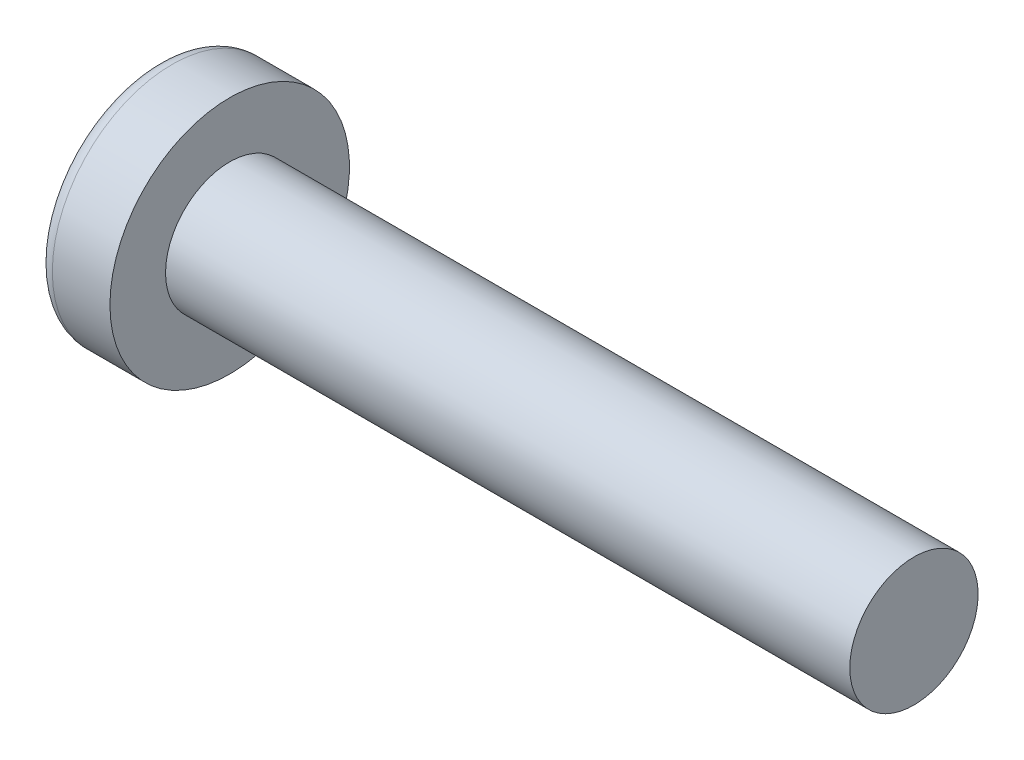
ISO-10303-21;
HEADER;
FILE_DESCRIPTION(('STEP AP214'),'2;1');
FILE_NAME('part.step','',(''),(''),'','','');
FILE_SCHEMA(('AUTOMOTIVE_DESIGN { 1 0 10303 214 1 1 1 1 }'));
ENDSEC;
DATA;
#1=APPLICATION_CONTEXT('core data for automotive mechanical design processes');
#2=APPLICATION_PROTOCOL_DEFINITION('international standard','automotive_design',2000,#1);
#3=PRODUCT_CONTEXT('',#1,'mechanical');
#4=PRODUCT('Part','Part','',(#3));
#5=PRODUCT_RELATED_PRODUCT_CATEGORY('part','',(#4));
#6=PRODUCT_DEFINITION_FORMATION('','',#4);
#7=PRODUCT_DEFINITION_CONTEXT('part definition',#1,'design');
#8=PRODUCT_DEFINITION('design','',#6,#7);
#9=PRODUCT_DEFINITION_SHAPE('','',#8);
#10=(LENGTH_UNIT() NAMED_UNIT(*) SI_UNIT(.MILLI.,.METRE.));
#11=(NAMED_UNIT(*) PLANE_ANGLE_UNIT() SI_UNIT($,.RADIAN.));
#12=(NAMED_UNIT(*) SI_UNIT($,.STERADIAN.) SOLID_ANGLE_UNIT());
#13=UNCERTAINTY_MEASURE_WITH_UNIT(LENGTH_MEASURE(1.E-05),#10,'distance_accuracy_value','');
#14=(GEOMETRIC_REPRESENTATION_CONTEXT(3) GLOBAL_UNCERTAINTY_ASSIGNED_CONTEXT((#13)) GLOBAL_UNIT_ASSIGNED_CONTEXT((#10,
#11,#12)) REPRESENTATION_CONTEXT('',''));
#15=CARTESIAN_POINT('',(0.,0.,0.));
#16=DIRECTION('',(0.,0.,1.));
#17=DIRECTION('',(1.,0.,0.));
#18=AXIS2_PLACEMENT_3D('',#15,#16,#17);
#19=CARTESIAN_POINT('',(5.,0.,0.));
#20=DIRECTION('',(-1.,0.,0.));
#21=DIRECTION('',(0.,1.,0.));
#22=AXIS2_PLACEMENT_3D('',#19,#20,#21);
#23=SPHERICAL_SURFACE('',#22,5.);
#24=CARTESIAN_POINT('',(0.747150706810473,0.,0.));
#25=DIRECTION('',(-1.,0.,0.));
#26=DIRECTION('',(0.,0.,1.));
#27=AXIS2_PLACEMENT_3D('',#24,#25,#26);
#28=CIRCLE('',#27,2.62931034482758);
#29=CARTESIAN_POINT('',(0.747150706810473,0.,2.62931034482758));
#30=VERTEX_POINT('',#29);
#31=EDGE_CURVE('E137',#30,#30,#28,.T.);
#32=ORIENTED_EDGE('',*,*,#31,.T.);
#33=EDGE_LOOP('',(#32));
#34=FACE_BOUND('',#33,.T.);
#35=CARTESIAN_POINT('',(4.98382636322272,-0.153868112043298,0.));
#36=DIRECTION('',(-0.104537710696287,-0.994520923380891,0.));
#37=DIRECTION('',(0.994520923380891,-0.104537710696287,0.));
#38=AXIS2_PLACEMENT_3D('',#35,#36,#37);
#39=CIRCLE('',#38,4.99760572850336);
#40=CARTESIAN_POINT('',(0.188596138461545,0.350175974082162,1.31444652548076));
#41=VERTEX_POINT('',#40);
#42=CARTESIAN_POINT('',(0.0270341343313624,0.367158343834487,0.367158343834487));
#43=VERTEX_POINT('',#42);
#44=EDGE_CURVE('E168',#41,#43,#39,.T.);
#45=ORIENTED_EDGE('',*,*,#44,.F.);
#46=CARTESIAN_POINT('',(3.98403090792016,0.,-1.41352221506761));
#47=DIRECTION('',(0.583636048152575,0.,0.812015371342713));
#48=DIRECTION('',(0.812015371342714,0.,-0.583636048152575));
#49=AXIS2_PLACEMENT_3D('',#46,#47,#48);
#50=CIRCLE('',#49,4.68719124331927);
#51=CARTESIAN_POINT('',(0.188596138461545,-0.350175974082172,1.31444652548076));
#52=VERTEX_POINT('',#51);
#53=EDGE_CURVE('E133',#41,#52,#50,.T.);
#54=ORIENTED_EDGE('',*,*,#53,.T.);
#55=CARTESIAN_POINT('',(4.98382636322272,0.153868112043298,0.));
#56=DIRECTION('',(-0.104537710696287,0.994520923380891,0.));
#57=DIRECTION('',(-0.994520923380891,-0.104537710696287,0.));
#58=AXIS2_PLACEMENT_3D('',#55,#56,#57);
#59=CIRCLE('',#58,4.99760572850336);
#60=CARTESIAN_POINT('',(0.0270341343313616,-0.367158343834489,0.367158343834487));
#61=VERTEX_POINT('',#60);
#62=EDGE_CURVE('E89',#61,#52,#59,.T.);
#63=ORIENTED_EDGE('',*,*,#62,.F.);
#64=CARTESIAN_POINT('',(4.98382636322272,0.,-0.153868112043298));
#65=DIRECTION('',(-0.104537710696287,0.,-0.994520923380891));
#66=DIRECTION('',(-0.994520923380891,0.,0.104537710696287));
#67=AXIS2_PLACEMENT_3D('',#64,#65,#66);
#68=CIRCLE('',#67,4.99760572850336);
#69=CARTESIAN_POINT('',(0.188596138461545,-1.31444652548077,0.350175974082167));
#70=VERTEX_POINT('',#69);
#71=EDGE_CURVE('E114',#70,#61,#68,.T.);
#72=ORIENTED_EDGE('',*,*,#71,.F.);
#73=CARTESIAN_POINT('',(3.98403090792016,1.41352221506761,0.));
#74=DIRECTION('',(0.583636048152575,-0.812015371342713,0.));
#75=DIRECTION('',(0.812015371342714,0.583636048152575,0.));
#76=AXIS2_PLACEMENT_3D('',#73,#74,#75);
#77=CIRCLE('',#76,4.68719124331927);
#78=CARTESIAN_POINT('',(0.188596138461545,-1.31444652548077,-0.350175974082167));
#79=VERTEX_POINT('',#78);
#80=EDGE_CURVE('E122',#70,#79,#77,.T.);
#81=ORIENTED_EDGE('',*,*,#80,.T.);
#82=CARTESIAN_POINT('',(4.98382636322272,0.,0.153868112043298));
#83=DIRECTION('',(-0.104537710696287,0.,0.994520923380891));
#84=DIRECTION('',(0.994520923380891,0.,0.104537710696287));
#85=AXIS2_PLACEMENT_3D('',#82,#83,#84);
#86=CIRCLE('',#85,4.99760572850336);
#87=CARTESIAN_POINT('',(0.0270341343313624,-0.367158343834486,-0.367158343834487));
#88=VERTEX_POINT('',#87);
#89=EDGE_CURVE('E32',#88,#79,#86,.T.);
#90=ORIENTED_EDGE('',*,*,#89,.F.);
#91=CARTESIAN_POINT('',(0.188596138461545,-0.350175974082162,-1.31444652548077));
#92=VERTEX_POINT('',#91);
#93=EDGE_CURVE('E175',#92,#88,#59,.T.);
#94=ORIENTED_EDGE('',*,*,#93,.F.);
#95=CARTESIAN_POINT('',(3.98403090792016,0.,1.41352221506761));
#96=DIRECTION('',(0.583636048152575,0.,-0.812015371342713));
#97=DIRECTION('',(-0.812015371342714,0.,-0.583636048152575));
#98=AXIS2_PLACEMENT_3D('',#95,#96,#97);
#99=CIRCLE('',#98,4.68719124331927);
#100=CARTESIAN_POINT('',(0.188596138461545,0.350175974082172,-1.31444652548076));
#101=VERTEX_POINT('',#100);
#102=EDGE_CURVE('E115',#92,#101,#99,.T.);
#103=ORIENTED_EDGE('',*,*,#102,.T.);
#104=CARTESIAN_POINT('',(0.0270341343313616,0.367158343834489,-0.367158343834487));
#105=VERTEX_POINT('',#104);
#106=EDGE_CURVE('E163',#105,#101,#39,.T.);
#107=ORIENTED_EDGE('',*,*,#106,.F.);
#108=CARTESIAN_POINT('',(0.188596138461545,1.31444652548076,-0.350175974082167));
#109=VERTEX_POINT('',#108);
#110=EDGE_CURVE('E25',#109,#105,#86,.T.);
#111=ORIENTED_EDGE('',*,*,#110,.F.);
#112=CARTESIAN_POINT('',(3.98403090792016,-1.41352221506761,0.));
#113=DIRECTION('',(0.583636048152575,0.812015371342713,0.));
#114=DIRECTION('',(-0.812015371342714,0.583636048152575,0.));
#115=AXIS2_PLACEMENT_3D('',#112,#113,#114);
#116=CIRCLE('',#115,4.68719124331927);
#117=CARTESIAN_POINT('',(0.188596138461545,1.31444652548076,0.350175974082167));
#118=VERTEX_POINT('',#117);
#119=EDGE_CURVE('E11',#109,#118,#116,.T.);
#120=ORIENTED_EDGE('',*,*,#119,.T.);
#121=EDGE_CURVE('E151',#43,#118,#68,.T.);
#122=ORIENTED_EDGE('',*,*,#121,.F.);
#123=EDGE_LOOP('',(#45,#54,#63,#72,#81,#90,#94,#103,#107,#111,#120,#122));
#124=FACE_BOUND('',#123,.T.);
#125=ADVANCED_FACE('F17',(#34,#124),#23,.T.);
#126=CARTESIAN_POINT('',(2.01739130434783,0.,-0.157944664031621));
#127=DIRECTION('',(-0.104537710696287,0.,0.994520923380891));
#128=DIRECTION('',(0.994520923380891,0.,0.104537710696287));
#129=AXIS2_PLACEMENT_3D('',#126,#127,#128);
#130=PLANE('',#129);
#131=ORIENTED_EDGE('',*,*,#110,.T.);
#132=DIRECTION('',(0.989130931836555,-0.103971149085093,0.103971149085092));
#133=VECTOR('',#132,1.);
#134=CARTESIAN_POINT('',(2.03363450411053,0.156237282238383,-0.156237282238382));
#135=LINE('',#134,#133);
#136=CARTESIAN_POINT('',(1.76,0.185,-0.185));
#137=VERTEX_POINT('',#136);
#138=EDGE_CURVE('E157',#105,#137,#135,.T.);
#139=ORIENTED_EDGE('',*,*,#138,.T.);
#140=DIRECTION('',(0.809073553388531,-0.581521616498006,0.0850446632823171));
#141=VECTOR('',#140,1.);
#142=CARTESIAN_POINT('',(0.,1.45,-0.37));
#143=LINE('',#142,#141);
#144=EDGE_CURVE('E138',#109,#137,#143,.T.);
#145=ORIENTED_EDGE('',*,*,#144,.F.);
#146=EDGE_LOOP('',(#131,#139,#145));
#147=FACE_BOUND('',#146,.T.);
#148=ADVANCED_FACE('F156',(#147),#130,.T.);
#149=DIRECTION('',(0.809073553388531,0.581521616498006,0.0850446632823171));
#150=VECTOR('',#149,1.);
#151=CARTESIAN_POINT('',(0.,-1.45,-0.37));
#152=LINE('',#151,#150);
#153=CARTESIAN_POINT('',(1.76,-0.185,-0.185));
#154=VERTEX_POINT('',#153);
#155=EDGE_CURVE('E123',#79,#154,#152,.T.);
#156=ORIENTED_EDGE('',*,*,#155,.T.);
#157=DIRECTION('',(-0.989130931836555,-0.103971149085092,-0.103971149085092));
#158=VECTOR('',#157,1.);
#159=CARTESIAN_POINT('',(2.03363450411053,-0.156237282238381,-0.156237282238382));
#160=LINE('',#159,#158);
#161=EDGE_CURVE('E178',#154,#88,#160,.T.);
#162=ORIENTED_EDGE('',*,*,#161,.T.);
#163=ORIENTED_EDGE('',*,*,#89,.T.);
#164=EDGE_LOOP('',(#156,#162,#163));
#165=FACE_BOUND('',#164,.T.);
#166=ADVANCED_FACE('F193',(#165),#130,.T.);
#167=CARTESIAN_POINT('',(2.01739130434783,0.,0.157944664031621));
#168=DIRECTION('',(-0.104537710696287,0.,-0.994520923380891));
#169=DIRECTION('',(-0.994520923380891,0.,0.104537710696287));
#170=AXIS2_PLACEMENT_3D('',#167,#168,#169);
#171=PLANE('',#170);
#172=DIRECTION('',(0.809073553388531,-0.581521616498006,-0.0850446632823172));
#173=VECTOR('',#172,1.);
#174=CARTESIAN_POINT('',(0.,1.45,0.37));
#175=LINE('',#174,#173);
#176=CARTESIAN_POINT('',(1.76,0.185,0.185));
#177=VERTEX_POINT('',#176);
#178=EDGE_CURVE('E194',#118,#177,#175,.T.);
#179=ORIENTED_EDGE('',*,*,#178,.T.);
#180=DIRECTION('',(-0.989130931836555,0.103971149085092,0.103971149085092));
#181=VECTOR('',#180,1.);
#182=CARTESIAN_POINT('',(2.03363450411053,0.156237282238381,0.156237282238382));
#183=LINE('',#182,#181);
#184=EDGE_CURVE('E172',#177,#43,#183,.T.);
#185=ORIENTED_EDGE('',*,*,#184,.T.);
#186=ORIENTED_EDGE('',*,*,#121,.T.);
#187=EDGE_LOOP('',(#179,#185,#186));
#188=FACE_BOUND('',#187,.T.);
#189=ADVANCED_FACE('F198',(#188),#171,.T.);
#190=ORIENTED_EDGE('',*,*,#71,.T.);
#191=DIRECTION('',(0.989130931836555,0.103971149085093,-0.103971149085092));
#192=VECTOR('',#191,1.);
#193=CARTESIAN_POINT('',(2.03363450411053,-0.156237282238383,0.156237282238382));
#194=LINE('',#193,#192);
#195=CARTESIAN_POINT('',(1.76,-0.185,0.185));
#196=VERTEX_POINT('',#195);
#197=EDGE_CURVE('E87',#61,#196,#194,.T.);
#198=ORIENTED_EDGE('',*,*,#197,.T.);
#199=DIRECTION('',(0.809073553388531,0.581521616498006,-0.085044663282317));
#200=VECTOR('',#199,1.);
#201=CARTESIAN_POINT('',(0.,-1.45,0.37));
#202=LINE('',#201,#200);
#203=EDGE_CURVE('E112',#70,#196,#202,.T.);
#204=ORIENTED_EDGE('',*,*,#203,.F.);
#205=EDGE_LOOP('',(#190,#198,#204));
#206=FACE_BOUND('',#205,.T.);
#207=ADVANCED_FACE('F111',(#206),#171,.T.);
#208=CARTESIAN_POINT('',(-25.4,0.,0.));
#209=DIRECTION('',(-1.,0.,0.));
#210=DIRECTION('',(0.,0.,1.));
#211=AXIS2_PLACEMENT_3D('',#208,#209,#210);
#212=CYLINDRICAL_SURFACE('',#211,1.5);
#213=CARTESIAN_POINT('',(18.4,0.,0.));
#214=DIRECTION('',(-1.,0.,0.));
#215=DIRECTION('',(0.,0.,1.));
#216=AXIS2_PLACEMENT_3D('',#213,#214,#215);
#217=CIRCLE('',#216,1.5);
#218=CARTESIAN_POINT('',(18.4,0.,1.5));
#219=VERTEX_POINT('',#218);
#220=EDGE_CURVE('E134',#219,#219,#217,.T.);
#221=ORIENTED_EDGE('',*,*,#220,.T.);
#222=EDGE_LOOP('',(#221));
#223=FACE_BOUND('',#222,.T.);
#224=CARTESIAN_POINT('',(2.4,0.,0.));
#225=DIRECTION('',(-1.,0.,0.));
#226=DIRECTION('',(0.,0.,1.));
#227=AXIS2_PLACEMENT_3D('',#224,#225,#226);
#228=CIRCLE('',#227,1.5);
#229=CARTESIAN_POINT('',(2.4,0.,1.5));
#230=VERTEX_POINT('',#229);
#231=EDGE_CURVE('E147',#230,#230,#228,.T.);
#232=ORIENTED_EDGE('',*,*,#231,.F.);
#233=EDGE_LOOP('',(#232));
#234=FACE_BOUND('',#233,.T.);
#235=ADVANCED_FACE('F19',(#223,#234),#212,.T.);
#236=CARTESIAN_POINT('',(2.4,1.5,0.));
#237=DIRECTION('',(-1.,0.,0.));
#238=DIRECTION('',(0.,0.,1.));
#239=AXIS2_PLACEMENT_3D('',#236,#237,#238);
#240=PLANE('',#239);
#241=CARTESIAN_POINT('',(2.4,0.,0.));
#242=DIRECTION('',(-1.,0.,0.));
#243=DIRECTION('',(0.,0.,1.));
#244=AXIS2_PLACEMENT_3D('',#241,#242,#243);
#245=CIRCLE('',#244,2.8);
#246=CARTESIAN_POINT('',(2.4,0.,2.8));
#247=VERTEX_POINT('',#246);
#248=EDGE_CURVE('E144',#247,#247,#245,.T.);
#249=ORIENTED_EDGE('',*,*,#248,.F.);
#250=EDGE_LOOP('',(#249));
#251=FACE_BOUND('',#250,.T.);
#252=ORIENTED_EDGE('',*,*,#231,.T.);
#253=EDGE_LOOP('',(#252));
#254=FACE_BOUND('',#253,.T.);
#255=ADVANCED_FACE('F229',(#251,#254),#240,.F.);
#256=CARTESIAN_POINT('',(-25.4,0.,0.));
#257=DIRECTION('',(-1.,0.,0.));
#258=DIRECTION('',(0.,0.,1.));
#259=AXIS2_PLACEMENT_3D('',#256,#257,#258);
#260=CYLINDRICAL_SURFACE('',#259,2.8);
#261=ORIENTED_EDGE('',*,*,#248,.T.);
#262=EDGE_LOOP('',(#261));
#263=FACE_BOUND('',#262,.T.);
#264=CARTESIAN_POINT('',(1.05335585592012,0.,0.));
#265=DIRECTION('',(-1.,0.,0.));
#266=DIRECTION('',(0.,0.,1.));
#267=AXIS2_PLACEMENT_3D('',#264,#265,#266);
#268=CIRCLE('',#267,2.8);
#269=CARTESIAN_POINT('',(1.05335585592012,0.,2.8));
#270=VERTEX_POINT('',#269);
#271=EDGE_CURVE('E141',#270,#270,#268,.T.);
#272=ORIENTED_EDGE('',*,*,#271,.F.);
#273=EDGE_LOOP('',(#272));
#274=FACE_BOUND('',#273,.T.);
#275=ADVANCED_FACE('F226',(#263,#274),#260,.T.);
#276=CARTESIAN_POINT('',(1.05335585592012,0.,0.));
#277=DIRECTION('',(-1.,0.,0.));
#278=DIRECTION('',(0.,0.,1.));
#279=AXIS2_PLACEMENT_3D('',#276,#277,#278);
#280=TOROIDAL_SURFACE('',#279,2.44,0.36);
#281=ORIENTED_EDGE('',*,*,#271,.T.);
#282=EDGE_LOOP('',(#281));
#283=FACE_BOUND('',#282,.T.);
#284=ORIENTED_EDGE('',*,*,#31,.F.);
#285=EDGE_LOOP('',(#284));
#286=FACE_BOUND('',#285,.T.);
#287=ADVANCED_FACE('F223',(#283,#286),#280,.T.);
#288=CARTESIAN_POINT('',(18.4,1.5,0.));
#289=DIRECTION('',(1.,0.,0.));
#290=DIRECTION('',(0.,0.,-1.));
#291=AXIS2_PLACEMENT_3D('',#288,#289,#290);
#292=PLANE('',#291);
#293=ORIENTED_EDGE('',*,*,#220,.F.);
#294=EDGE_LOOP('',(#293));
#295=FACE_BOUND('',#294,.T.);
#296=ADVANCED_FACE('F221',(#295),#292,.T.);
#297=CARTESIAN_POINT('',(1.76,0.185,0.185));
#298=DIRECTION('',(0.583636048152575,0.812015371342713,0.));
#299=DIRECTION('',(-0.812015371342714,0.583636048152575,0.));
#300=AXIS2_PLACEMENT_3D('',#297,#298,#299);
#301=PLANE('',#300);
#302=ORIENTED_EDGE('',*,*,#144,.T.);
#303=DIRECTION('',(0.,0.,-1.));
#304=VECTOR('',#303,1.);
#305=CARTESIAN_POINT('',(1.76,0.185,0.185));
#306=LINE('',#305,#304);
#307=EDGE_CURVE('E105',#177,#137,#306,.T.);
#308=ORIENTED_EDGE('',*,*,#307,.F.);
#309=ORIENTED_EDGE('',*,*,#178,.F.);
#310=ORIENTED_EDGE('',*,*,#119,.F.);
#311=EDGE_LOOP('',(#302,#308,#309,#310));
#312=FACE_BOUND('',#311,.T.);
#313=ADVANCED_FACE('F197',(#312),#301,.F.);
#314=CARTESIAN_POINT('',(1.76,-0.185,-0.185));
#315=DIRECTION('',(0.583636048152575,-0.812015371342713,0.));
#316=DIRECTION('',(0.812015371342714,0.583636048152575,0.));
#317=AXIS2_PLACEMENT_3D('',#314,#315,#316);
#318=PLANE('',#317);
#319=ORIENTED_EDGE('',*,*,#203,.T.);
#320=DIRECTION('',(0.,0.,1.));
#321=VECTOR('',#320,1.);
#322=CARTESIAN_POINT('',(1.76,-0.185,-0.185));
#323=LINE('',#322,#321);
#324=EDGE_CURVE('E104',#154,#196,#323,.T.);
#325=ORIENTED_EDGE('',*,*,#324,.F.);
#326=ORIENTED_EDGE('',*,*,#155,.F.);
#327=ORIENTED_EDGE('',*,*,#80,.F.);
#328=EDGE_LOOP('',(#319,#325,#326,#327));
#329=FACE_BOUND('',#328,.T.);
#330=ADVANCED_FACE('F119',(#329),#318,.F.);
#331=CARTESIAN_POINT('',(1.76,0.185,-0.185));
#332=DIRECTION('',(-1.,0.,0.));
#333=DIRECTION('',(0.,0.,1.));
#334=AXIS2_PLACEMENT_3D('',#331,#332,#333);
#335=PLANE('',#334);
#336=DIRECTION('',(0.,1.,0.));
#337=VECTOR('',#336,1.);
#338=CARTESIAN_POINT('',(1.76,-0.185,-0.185));
#339=LINE('',#338,#337);
#340=EDGE_CURVE('E127',#154,#137,#339,.T.);
#341=ORIENTED_EDGE('',*,*,#340,.F.);
#342=ORIENTED_EDGE('',*,*,#324,.T.);
#343=DIRECTION('',(0.,-1.,0.));
#344=VECTOR('',#343,1.);
#345=CARTESIAN_POINT('',(1.76,0.185,0.185));
#346=LINE('',#345,#344);
#347=EDGE_CURVE('E96',#177,#196,#346,.T.);
#348=ORIENTED_EDGE('',*,*,#347,.F.);
#349=ORIENTED_EDGE('',*,*,#307,.T.);
#350=EDGE_LOOP('',(#341,#342,#348,#349));
#351=FACE_BOUND('',#350,.T.);
#352=ADVANCED_FACE('F125',(#351),#335,.T.);
#353=CARTESIAN_POINT('',(1.76,0.185,-0.185));
#354=DIRECTION('',(0.583636048152575,0.,-0.812015371342713));
#355=DIRECTION('',(0.812015371342714,0.,0.583636048152575));
#356=AXIS2_PLACEMENT_3D('',#353,#354,#355);
#357=PLANE('',#356);
#358=DIRECTION('',(0.809073553388531,0.085044663282315,0.581521616498007));
#359=VECTOR('',#358,1.);
#360=CARTESIAN_POINT('',(0.,-0.369999999999994,-1.45));
#361=LINE('',#360,#359);
#362=EDGE_CURVE('E183',#92,#154,#361,.T.);
#363=ORIENTED_EDGE('',*,*,#362,.T.);
#364=ORIENTED_EDGE('',*,*,#340,.T.);
#365=DIRECTION('',(0.809073553388531,-0.0850446632823192,0.581521616498006));
#366=VECTOR('',#365,1.);
#367=CARTESIAN_POINT('',(0.,0.370000000000005,-1.45));
#368=LINE('',#367,#366);
#369=EDGE_CURVE('E93',#101,#137,#368,.T.);
#370=ORIENTED_EDGE('',*,*,#369,.F.);
#371=ORIENTED_EDGE('',*,*,#102,.F.);
#372=EDGE_LOOP('',(#363,#364,#370,#371));
#373=FACE_BOUND('',#372,.T.);
#374=ADVANCED_FACE('F188',(#373),#357,.F.);
#375=CARTESIAN_POINT('',(2.01739130434783,-0.157944664031621,0.));
#376=DIRECTION('',(-0.104537710696287,0.994520923380891,0.));
#377=DIRECTION('',(-0.994520923380891,-0.104537710696287,0.));
#378=AXIS2_PLACEMENT_3D('',#375,#376,#377);
#379=PLANE('',#378);
#380=ORIENTED_EDGE('',*,*,#93,.T.);
#381=ORIENTED_EDGE('',*,*,#161,.F.);
#382=ORIENTED_EDGE('',*,*,#362,.F.);
#383=EDGE_LOOP('',(#380,#381,#382));
#384=FACE_BOUND('',#383,.T.);
#385=ADVANCED_FACE('F192',(#384),#379,.T.);
#386=CARTESIAN_POINT('',(2.01739130434783,0.157944664031621,0.));
#387=DIRECTION('',(-0.104537710696287,-0.994520923380891,0.));
#388=DIRECTION('',(0.994520923380891,-0.104537710696287,0.));
#389=AXIS2_PLACEMENT_3D('',#386,#387,#388);
#390=PLANE('',#389);
#391=ORIENTED_EDGE('',*,*,#106,.T.);
#392=ORIENTED_EDGE('',*,*,#369,.T.);
#393=ORIENTED_EDGE('',*,*,#138,.F.);
#394=EDGE_LOOP('',(#391,#392,#393));
#395=FACE_BOUND('',#394,.T.);
#396=ADVANCED_FACE('F186',(#395),#390,.T.);
#397=CARTESIAN_POINT('',(1.76,-0.185,0.185));
#398=DIRECTION('',(0.583636048152575,0.,0.812015371342713));
#399=DIRECTION('',(-0.812015371342714,0.,0.583636048152575));
#400=AXIS2_PLACEMENT_3D('',#397,#398,#399);
#401=PLANE('',#400);
#402=DIRECTION('',(0.809073553388531,-0.0850446632823151,-0.581521616498007));
#403=VECTOR('',#402,1.);
#404=CARTESIAN_POINT('',(0.,0.369999999999995,1.45));
#405=LINE('',#404,#403);
#406=EDGE_CURVE('E92',#41,#177,#405,.T.);
#407=ORIENTED_EDGE('',*,*,#406,.T.);
#408=ORIENTED_EDGE('',*,*,#347,.T.);
#409=DIRECTION('',(0.809073553388531,0.0850446632823192,-0.581521616498006));
#410=VECTOR('',#409,1.);
#411=CARTESIAN_POINT('',(0.,-0.370000000000005,1.45));
#412=LINE('',#411,#410);
#413=EDGE_CURVE('E83',#52,#196,#412,.T.);
#414=ORIENTED_EDGE('',*,*,#413,.F.);
#415=ORIENTED_EDGE('',*,*,#53,.F.);
#416=EDGE_LOOP('',(#407,#408,#414,#415));
#417=FACE_BOUND('',#416,.T.);
#418=ADVANCED_FACE('F97',(#417),#401,.F.);
#419=ORIENTED_EDGE('',*,*,#44,.T.);
#420=ORIENTED_EDGE('',*,*,#184,.F.);
#421=ORIENTED_EDGE('',*,*,#406,.F.);
#422=EDGE_LOOP('',(#419,#420,#421));
#423=FACE_BOUND('',#422,.T.);
#424=ADVANCED_FACE('F199',(#423),#390,.T.);
#425=ORIENTED_EDGE('',*,*,#62,.T.);
#426=ORIENTED_EDGE('',*,*,#413,.T.);
#427=ORIENTED_EDGE('',*,*,#197,.F.);
#428=EDGE_LOOP('',(#425,#426,#427));
#429=FACE_BOUND('',#428,.T.);
#430=ADVANCED_FACE('F85',(#429),#379,.T.);
#431=CLOSED_SHELL('',(#125,#148,#166,#189,#207,#235,#255,#275,#287,#296,#313,#330,#352,#374,
#385,#396,#418,#424,#430));
#432=MANIFOLD_SOLID_BREP('B1',#431);
#433=ADVANCED_BREP_SHAPE_REPRESENTATION('',(#18,#432),#14);
#434=SHAPE_DEFINITION_REPRESENTATION(#9,#433);
ENDSEC;
END-ISO-10303-21;
